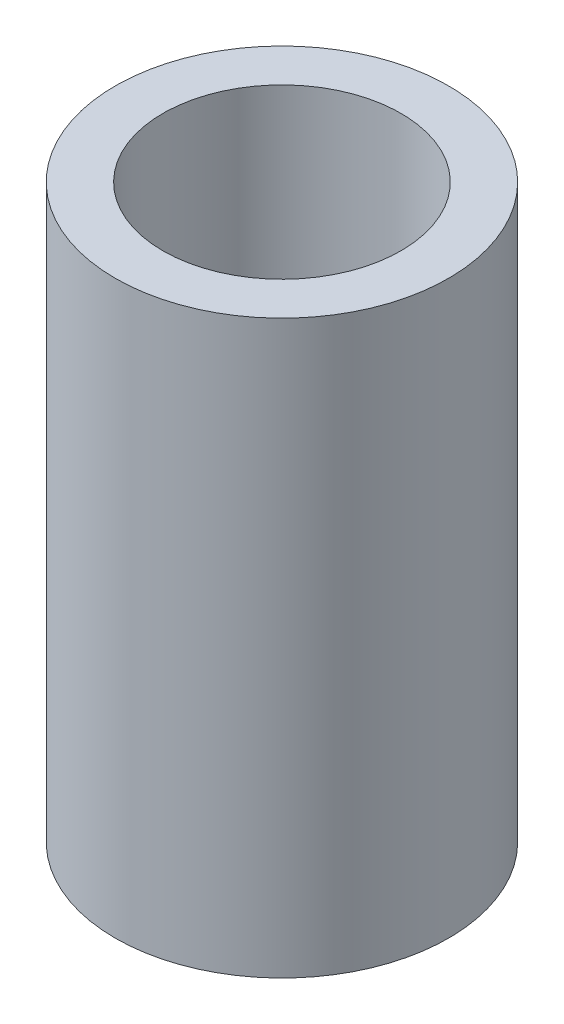
ISO-10303-21;
HEADER;
FILE_DESCRIPTION(('STEP AP214'),'2;1');
FILE_NAME('part.step','',(''),(''),'','','');
FILE_SCHEMA(('AUTOMOTIVE_DESIGN { 1 0 10303 214 1 1 1 1 }'));
ENDSEC;
DATA;
#1=APPLICATION_CONTEXT('core data for automotive mechanical design processes');
#2=APPLICATION_PROTOCOL_DEFINITION('international standard','automotive_design',2000,#1);
#3=PRODUCT_CONTEXT('',#1,'mechanical');
#4=PRODUCT('Part','Part','',(#3));
#5=PRODUCT_RELATED_PRODUCT_CATEGORY('part','',(#4));
#6=PRODUCT_DEFINITION_FORMATION('','',#4);
#7=PRODUCT_DEFINITION_CONTEXT('part definition',#1,'design');
#8=PRODUCT_DEFINITION('design','',#6,#7);
#9=PRODUCT_DEFINITION_SHAPE('','',#8);
#10=(LENGTH_UNIT() NAMED_UNIT(*) SI_UNIT(.MILLI.,.METRE.));
#11=(NAMED_UNIT(*) PLANE_ANGLE_UNIT() SI_UNIT($,.RADIAN.));
#12=(NAMED_UNIT(*) SI_UNIT($,.STERADIAN.) SOLID_ANGLE_UNIT());
#13=UNCERTAINTY_MEASURE_WITH_UNIT(LENGTH_MEASURE(1.E-05),#10,'distance_accuracy_value','');
#14=(GEOMETRIC_REPRESENTATION_CONTEXT(3) GLOBAL_UNCERTAINTY_ASSIGNED_CONTEXT((#13)) GLOBAL_UNIT_ASSIGNED_CONTEXT((#10,
#11,#12)) REPRESENTATION_CONTEXT('',''));
#15=CARTESIAN_POINT('',(0.,0.,0.));
#16=DIRECTION('',(0.,0.,1.));
#17=DIRECTION('',(1.,0.,0.));
#18=AXIS2_PLACEMENT_3D('',#15,#16,#17);
#19=CARTESIAN_POINT('',(0.,38.1,0.));
#20=DIRECTION('',(0.,1.,0.));
#21=DIRECTION('',(0.,0.,1.));
#22=AXIS2_PLACEMENT_3D('',#19,#20,#21);
#23=PLANE('',#22);
#24=CARTESIAN_POINT('',(0.,38.1,0.));
#25=DIRECTION('',(0.,1.,0.));
#26=DIRECTION('',(0.,0.,1.));
#27=AXIS2_PLACEMENT_3D('',#24,#25,#26);
#28=CIRCLE('',#27,11.1125);
#29=CARTESIAN_POINT('',(0.,38.1,11.1125));
#30=VERTEX_POINT('',#29);
#31=EDGE_CURVE('E10',#30,#30,#28,.T.);
#32=ORIENTED_EDGE('',*,*,#31,.T.);
#33=EDGE_LOOP('',(#32));
#34=FACE_BOUND('',#33,.T.);
#35=CARTESIAN_POINT('',(0.,38.1,0.));
#36=DIRECTION('',(0.,1.,0.));
#37=DIRECTION('',(0.,0.,1.));
#38=AXIS2_PLACEMENT_3D('',#35,#36,#37);
#39=CIRCLE('',#38,7.9375);
#40=CARTESIAN_POINT('',(0.,38.1,7.9375));
#41=VERTEX_POINT('',#40);
#42=EDGE_CURVE('E54',#41,#41,#39,.T.);
#43=ORIENTED_EDGE('',*,*,#42,.F.);
#44=EDGE_LOOP('',(#43));
#45=FACE_BOUND('',#44,.T.);
#46=ADVANCED_FACE('F39',(#34,#45),#23,.T.);
#47=CARTESIAN_POINT('',(0.,0.,0.));
#48=DIRECTION('',(0.,1.,0.));
#49=DIRECTION('',(0.,0.,1.));
#50=AXIS2_PLACEMENT_3D('',#47,#48,#49);
#51=PLANE('',#50);
#52=CARTESIAN_POINT('',(0.,0.,0.));
#53=DIRECTION('',(0.,1.,0.));
#54=DIRECTION('',(0.,0.,1.));
#55=AXIS2_PLACEMENT_3D('',#52,#53,#54);
#56=CIRCLE('',#55,11.1125);
#57=CARTESIAN_POINT('',(0.,0.,11.1125));
#58=VERTEX_POINT('',#57);
#59=EDGE_CURVE('E43',#58,#58,#56,.T.);
#60=ORIENTED_EDGE('',*,*,#59,.F.);
#61=EDGE_LOOP('',(#60));
#62=FACE_BOUND('',#61,.T.);
#63=CARTESIAN_POINT('',(0.,0.,0.));
#64=DIRECTION('',(0.,1.,0.));
#65=DIRECTION('',(0.,0.,1.));
#66=AXIS2_PLACEMENT_3D('',#63,#64,#65);
#67=CIRCLE('',#66,7.9375);
#68=CARTESIAN_POINT('',(0.,0.,7.9375));
#69=VERTEX_POINT('',#68);
#70=EDGE_CURVE('E56',#69,#69,#67,.T.);
#71=ORIENTED_EDGE('',*,*,#70,.T.);
#72=EDGE_LOOP('',(#71));
#73=FACE_BOUND('',#72,.T.);
#74=ADVANCED_FACE('F68',(#62,#73),#51,.F.);
#75=CARTESIAN_POINT('',(0.,38.1,0.));
#76=DIRECTION('',(0.,-1.,0.));
#77=DIRECTION('',(0.,0.,-1.));
#78=AXIS2_PLACEMENT_3D('',#75,#76,#77);
#79=CYLINDRICAL_SURFACE('',#78,11.1125);
#80=ORIENTED_EDGE('',*,*,#31,.F.);
#81=EDGE_LOOP('',(#80));
#82=FACE_BOUND('',#81,.T.);
#83=ORIENTED_EDGE('',*,*,#59,.T.);
#84=EDGE_LOOP('',(#83));
#85=FACE_BOUND('',#84,.T.);
#86=ADVANCED_FACE('F41',(#82,#85),#79,.T.);
#87=CARTESIAN_POINT('',(0.,38.1,0.));
#88=DIRECTION('',(0.,-1.,0.));
#89=DIRECTION('',(0.,0.,-1.));
#90=AXIS2_PLACEMENT_3D('',#87,#88,#89);
#91=CYLINDRICAL_SURFACE('',#90,7.9375);
#92=ORIENTED_EDGE('',*,*,#42,.T.);
#93=EDGE_LOOP('',(#92));
#94=FACE_BOUND('',#93,.T.);
#95=ORIENTED_EDGE('',*,*,#70,.F.);
#96=EDGE_LOOP('',(#95));
#97=FACE_BOUND('',#96,.T.);
#98=ADVANCED_FACE('F64',(#94,#97),#91,.F.);
#99=CLOSED_SHELL('',(#46,#74,#86,#98));
#100=MANIFOLD_SOLID_BREP('B2',#99);
#101=ADVANCED_BREP_SHAPE_REPRESENTATION('',(#18,#100),#14);
#102=SHAPE_DEFINITION_REPRESENTATION(#9,#101);
ENDSEC;
END-ISO-10303-21;
